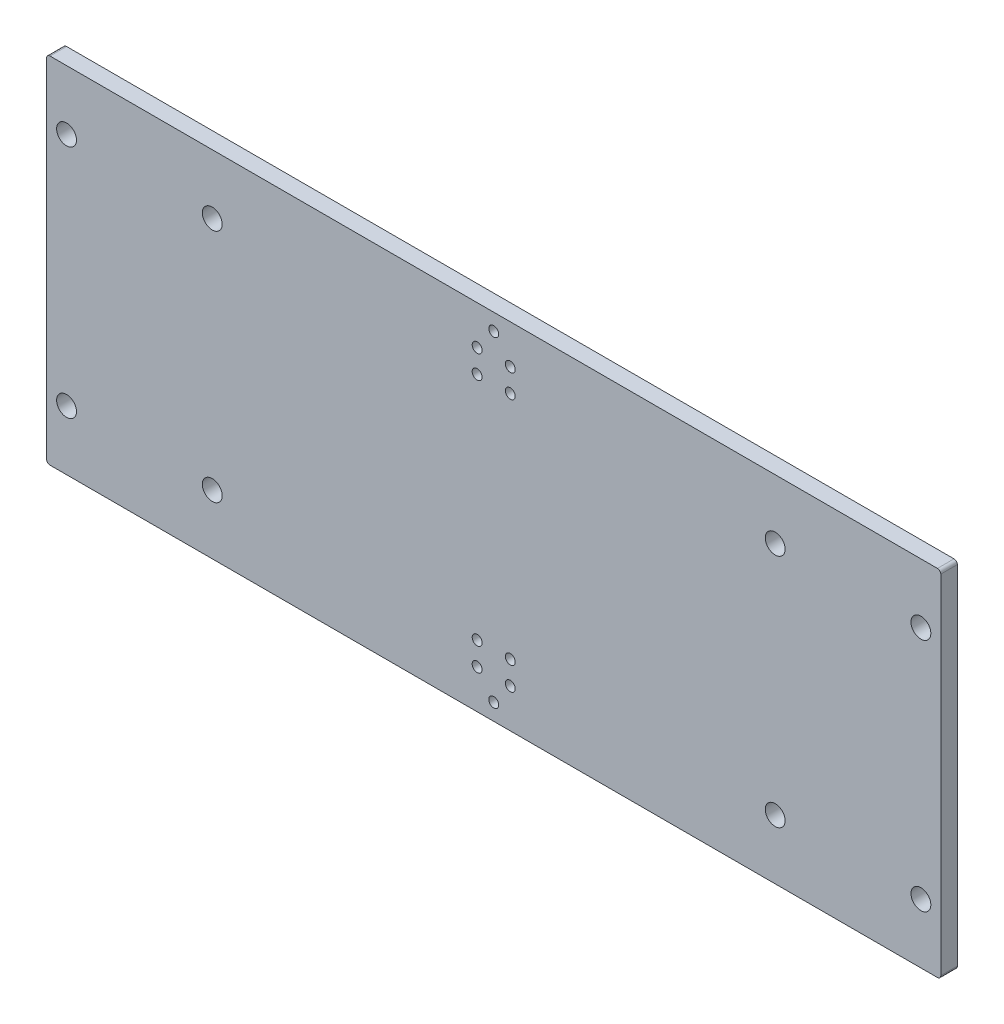
ISO-10303-21;
HEADER;
FILE_DESCRIPTION(('STEP AP214'),'2;1');
FILE_NAME('part.step','',(''),(''),'','','');
FILE_SCHEMA(('AUTOMOTIVE_DESIGN { 1 0 10303 214 1 1 1 1 }'));
ENDSEC;
DATA;
#1=APPLICATION_CONTEXT('core data for automotive mechanical design processes');
#2=APPLICATION_PROTOCOL_DEFINITION('international standard','automotive_design',2000,#1);
#3=PRODUCT_CONTEXT('',#1,'mechanical');
#4=PRODUCT('Part','Part','',(#3));
#5=PRODUCT_RELATED_PRODUCT_CATEGORY('part','',(#4));
#6=PRODUCT_DEFINITION_FORMATION('','',#4);
#7=PRODUCT_DEFINITION_CONTEXT('part definition',#1,'design');
#8=PRODUCT_DEFINITION('design','',#6,#7);
#9=PRODUCT_DEFINITION_SHAPE('','',#8);
#10=(LENGTH_UNIT() NAMED_UNIT(*) SI_UNIT(.MILLI.,.METRE.));
#11=(NAMED_UNIT(*) PLANE_ANGLE_UNIT() SI_UNIT($,.RADIAN.));
#12=(NAMED_UNIT(*) SI_UNIT($,.STERADIAN.) SOLID_ANGLE_UNIT());
#13=UNCERTAINTY_MEASURE_WITH_UNIT(LENGTH_MEASURE(1.E-05),#10,'distance_accuracy_value','');
#14=(GEOMETRIC_REPRESENTATION_CONTEXT(3) GLOBAL_UNCERTAINTY_ASSIGNED_CONTEXT((#13)) GLOBAL_UNIT_ASSIGNED_CONTEXT((#10,
#11,#12)) REPRESENTATION_CONTEXT('',''));
#15=CARTESIAN_POINT('',(0.,0.,0.));
#16=DIRECTION('',(0.,0.,1.));
#17=DIRECTION('',(1.,0.,0.));
#18=AXIS2_PLACEMENT_3D('',#15,#16,#17);
#19=CARTESIAN_POINT('',(135.,-53.5,-5.));
#20=DIRECTION('',(1.,0.,0.));
#21=DIRECTION('',(0.,0.,-1.));
#22=AXIS2_PLACEMENT_3D('',#19,#20,#21);
#23=PLANE('',#22);
#24=DIRECTION('',(0.,1.,0.));
#25=VECTOR('',#24,1.);
#26=CARTESIAN_POINT('',(135.,-53.5,0.));
#27=LINE('',#26,#25);
#28=CARTESIAN_POINT('',(135.,-52.5,0.));
#29=VERTEX_POINT('',#28);
#30=CARTESIAN_POINT('',(135.,52.5,0.));
#31=VERTEX_POINT('',#30);
#32=EDGE_CURVE('E258',#29,#31,#27,.T.);
#33=ORIENTED_EDGE('',*,*,#32,.F.);
#34=DIRECTION('',(0.,0.,1.));
#35=VECTOR('',#34,1.);
#36=CARTESIAN_POINT('',(135.,-52.5,-5.));
#37=LINE('',#36,#35);
#38=CARTESIAN_POINT('',(135.,-52.5,-5.));
#39=VERTEX_POINT('',#38);
#40=EDGE_CURVE('E11',#29,#39,#37,.F.);
#41=ORIENTED_EDGE('',*,*,#40,.T.);
#42=DIRECTION('',(0.,1.,0.));
#43=VECTOR('',#42,1.);
#44=CARTESIAN_POINT('',(135.,-53.5,-5.));
#45=LINE('',#44,#43);
#46=CARTESIAN_POINT('',(135.,52.5,-5.));
#47=VERTEX_POINT('',#46);
#48=EDGE_CURVE('E259',#39,#47,#45,.T.);
#49=ORIENTED_EDGE('',*,*,#48,.T.);
#50=DIRECTION('',(0.,0.,1.));
#51=VECTOR('',#50,1.);
#52=CARTESIAN_POINT('',(135.,52.5,-5.));
#53=LINE('',#52,#51);
#54=EDGE_CURVE('E49',#47,#31,#53,.T.);
#55=ORIENTED_EDGE('',*,*,#54,.T.);
#56=EDGE_LOOP('',(#33,#41,#49,#55));
#57=FACE_BOUND('',#56,.T.);
#58=ADVANCED_FACE('F40',(#57),#23,.T.);
#59=CARTESIAN_POINT('',(-135.,-53.5,-5.));
#60=DIRECTION('',(0.,-1.,0.));
#61=DIRECTION('',(0.,0.,-1.));
#62=AXIS2_PLACEMENT_3D('',#59,#60,#61);
#63=PLANE('',#62);
#64=DIRECTION('',(1.,0.,0.));
#65=VECTOR('',#64,1.);
#66=CARTESIAN_POINT('',(-135.,-53.5,0.));
#67=LINE('',#66,#65);
#68=CARTESIAN_POINT('',(-134.,-53.5,0.));
#69=VERTEX_POINT('',#68);
#70=CARTESIAN_POINT('',(134.,-53.5,0.));
#71=VERTEX_POINT('',#70);
#72=EDGE_CURVE('E127',#69,#71,#67,.T.);
#73=ORIENTED_EDGE('',*,*,#72,.F.);
#74=DIRECTION('',(0.,0.,1.));
#75=VECTOR('',#74,1.);
#76=CARTESIAN_POINT('',(-134.,-53.5,-5.));
#77=LINE('',#76,#75);
#78=CARTESIAN_POINT('',(-134.,-53.5,-5.));
#79=VERTEX_POINT('',#78);
#80=EDGE_CURVE('E145',#69,#79,#77,.F.);
#81=ORIENTED_EDGE('',*,*,#80,.T.);
#82=DIRECTION('',(1.,0.,0.));
#83=VECTOR('',#82,1.);
#84=CARTESIAN_POINT('',(-135.,-53.5,-5.));
#85=LINE('',#84,#83);
#86=CARTESIAN_POINT('',(134.,-53.5,-5.));
#87=VERTEX_POINT('',#86);
#88=EDGE_CURVE('E130',#79,#87,#85,.T.);
#89=ORIENTED_EDGE('',*,*,#88,.T.);
#90=DIRECTION('',(0.,0.,1.));
#91=VECTOR('',#90,1.);
#92=CARTESIAN_POINT('',(134.,-53.5,-5.));
#93=LINE('',#92,#91);
#94=EDGE_CURVE('E142',#87,#71,#93,.T.);
#95=ORIENTED_EDGE('',*,*,#94,.T.);
#96=EDGE_LOOP('',(#73,#81,#89,#95));
#97=FACE_BOUND('',#96,.T.);
#98=ADVANCED_FACE('F282',(#97),#63,.T.);
#99=CARTESIAN_POINT('',(-135.,-53.5,-5.));
#100=DIRECTION('',(-1.,0.,0.));
#101=DIRECTION('',(0.,0.,1.));
#102=AXIS2_PLACEMENT_3D('',#99,#100,#101);
#103=PLANE('',#102);
#104=DIRECTION('',(0.,-1.,0.));
#105=VECTOR('',#104,1.);
#106=CARTESIAN_POINT('',(-135.,-53.5,-5.));
#107=LINE('',#106,#105);
#108=CARTESIAN_POINT('',(-135.,52.5,-5.));
#109=VERTEX_POINT('',#108);
#110=CARTESIAN_POINT('',(-135.,-52.5,-5.));
#111=VERTEX_POINT('',#110);
#112=EDGE_CURVE('E135',#109,#111,#107,.T.);
#113=ORIENTED_EDGE('',*,*,#112,.T.);
#114=DIRECTION('',(0.,0.,1.));
#115=VECTOR('',#114,1.);
#116=CARTESIAN_POINT('',(-135.,-52.5,-5.));
#117=LINE('',#116,#115);
#118=CARTESIAN_POINT('',(-135.,-52.5,0.));
#119=VERTEX_POINT('',#118);
#120=EDGE_CURVE('E126',#111,#119,#117,.T.);
#121=ORIENTED_EDGE('',*,*,#120,.T.);
#122=DIRECTION('',(0.,-1.,0.));
#123=VECTOR('',#122,1.);
#124=CARTESIAN_POINT('',(-135.,-53.5,0.));
#125=LINE('',#124,#123);
#126=CARTESIAN_POINT('',(-135.,52.5,0.));
#127=VERTEX_POINT('',#126);
#128=EDGE_CURVE('E111',#127,#119,#125,.T.);
#129=ORIENTED_EDGE('',*,*,#128,.F.);
#130=DIRECTION('',(0.,0.,1.));
#131=VECTOR('',#130,1.);
#132=CARTESIAN_POINT('',(-135.,52.5,-5.));
#133=LINE('',#132,#131);
#134=EDGE_CURVE('E124',#127,#109,#133,.F.);
#135=ORIENTED_EDGE('',*,*,#134,.T.);
#136=EDGE_LOOP('',(#113,#121,#129,#135));
#137=FACE_BOUND('',#136,.T.);
#138=ADVANCED_FACE('F123',(#137),#103,.T.);
#139=CARTESIAN_POINT('',(-135.,53.5,-5.));
#140=DIRECTION('',(0.,1.,0.));
#141=DIRECTION('',(0.,0.,1.));
#142=AXIS2_PLACEMENT_3D('',#139,#140,#141);
#143=PLANE('',#142);
#144=DIRECTION('',(-1.,0.,0.));
#145=VECTOR('',#144,1.);
#146=CARTESIAN_POINT('',(-135.,53.5,-5.));
#147=LINE('',#146,#145);
#148=CARTESIAN_POINT('',(134.,53.5,-5.));
#149=VERTEX_POINT('',#148);
#150=CARTESIAN_POINT('',(-134.,53.5,-5.));
#151=VERTEX_POINT('',#150);
#152=EDGE_CURVE('E262',#149,#151,#147,.T.);
#153=ORIENTED_EDGE('',*,*,#152,.T.);
#154=DIRECTION('',(0.,0.,1.));
#155=VECTOR('',#154,1.);
#156=CARTESIAN_POINT('',(-134.,53.5,-5.));
#157=LINE('',#156,#155);
#158=CARTESIAN_POINT('',(-134.,53.5,0.));
#159=VERTEX_POINT('',#158);
#160=EDGE_CURVE('E155',#151,#159,#157,.T.);
#161=ORIENTED_EDGE('',*,*,#160,.T.);
#162=DIRECTION('',(-1.,0.,0.));
#163=VECTOR('',#162,1.);
#164=CARTESIAN_POINT('',(-135.,53.5,0.));
#165=LINE('',#164,#163);
#166=CARTESIAN_POINT('',(134.,53.5,0.));
#167=VERTEX_POINT('',#166);
#168=EDGE_CURVE('E112',#167,#159,#165,.T.);
#169=ORIENTED_EDGE('',*,*,#168,.F.);
#170=DIRECTION('',(0.,0.,1.));
#171=VECTOR('',#170,1.);
#172=CARTESIAN_POINT('',(134.,53.5,-5.));
#173=LINE('',#172,#171);
#174=EDGE_CURVE('E64',#167,#149,#173,.F.);
#175=ORIENTED_EDGE('',*,*,#174,.T.);
#176=EDGE_LOOP('',(#153,#161,#169,#175));
#177=FACE_BOUND('',#176,.T.);
#178=ADVANCED_FACE('F305',(#177),#143,.T.);
#179=CARTESIAN_POINT('',(0.,0.,-5.));
#180=DIRECTION('',(0.,0.,-1.));
#181=DIRECTION('',(-1.,0.,0.));
#182=AXIS2_PLACEMENT_3D('',#179,#180,#181);
#183=PLANE('',#182);
#184=CARTESIAN_POINT('',(5.,-34.75,-5.));
#185=DIRECTION('',(0.,0.,1.));
#186=DIRECTION('',(-1.,0.,0.));
#187=AXIS2_PLACEMENT_3D('',#184,#185,#186);
#188=CIRCLE('',#187,1.5);
#189=CARTESIAN_POINT('',(3.5,-34.75,-5.));
#190=VERTEX_POINT('',#189);
#191=EDGE_CURVE('E440',#190,#190,#188,.T.);
#192=ORIENTED_EDGE('',*,*,#191,.T.);
#193=EDGE_LOOP('',(#192));
#194=FACE_BOUND('',#193,.T.);
#195=CARTESIAN_POINT('',(-5.,-34.75,-5.));
#196=DIRECTION('',(0.,0.,1.));
#197=DIRECTION('',(-1.,0.,0.));
#198=AXIS2_PLACEMENT_3D('',#195,#196,#197);
#199=CIRCLE('',#198,1.5);
#200=CARTESIAN_POINT('',(-6.5,-34.75,-5.));
#201=VERTEX_POINT('',#200);
#202=EDGE_CURVE('E435',#201,#201,#199,.T.);
#203=ORIENTED_EDGE('',*,*,#202,.T.);
#204=EDGE_LOOP('',(#203));
#205=FACE_BOUND('',#204,.T.);
#206=CARTESIAN_POINT('',(-5.,-41.75,-5.));
#207=DIRECTION('',(0.,0.,1.));
#208=DIRECTION('',(-1.,0.,0.));
#209=AXIS2_PLACEMENT_3D('',#206,#207,#208);
#210=CIRCLE('',#209,1.5);
#211=CARTESIAN_POINT('',(-6.5,-41.75,-5.));
#212=VERTEX_POINT('',#211);
#213=EDGE_CURVE('E386',#212,#212,#210,.T.);
#214=ORIENTED_EDGE('',*,*,#213,.T.);
#215=EDGE_LOOP('',(#214));
#216=FACE_BOUND('',#215,.T.);
#217=CARTESIAN_POINT('',(5.,-41.75,-5.));
#218=DIRECTION('',(0.,0.,1.));
#219=DIRECTION('',(-1.,0.,0.));
#220=AXIS2_PLACEMENT_3D('',#217,#218,#219);
#221=CIRCLE('',#220,1.5);
#222=CARTESIAN_POINT('',(3.5,-41.75,-5.));
#223=VERTEX_POINT('',#222);
#224=EDGE_CURVE('E177',#223,#223,#221,.T.);
#225=ORIENTED_EDGE('',*,*,#224,.T.);
#226=EDGE_LOOP('',(#225));
#227=FACE_BOUND('',#226,.T.);
#228=CARTESIAN_POINT('',(5.,34.75,-5.));
#229=DIRECTION('',(0.,0.,-1.));
#230=DIRECTION('',(-1.,0.,0.));
#231=AXIS2_PLACEMENT_3D('',#228,#229,#230);
#232=CIRCLE('',#231,1.5);
#233=CARTESIAN_POINT('',(3.5,34.75,-5.));
#234=VERTEX_POINT('',#233);
#235=EDGE_CURVE('E184',#234,#234,#232,.T.);
#236=ORIENTED_EDGE('',*,*,#235,.F.);
#237=EDGE_LOOP('',(#236));
#238=FACE_BOUND('',#237,.T.);
#239=CARTESIAN_POINT('',(-5.,34.75,-5.));
#240=DIRECTION('',(0.,0.,-1.));
#241=DIRECTION('',(-1.,0.,0.));
#242=AXIS2_PLACEMENT_3D('',#239,#240,#241);
#243=CIRCLE('',#242,1.5);
#244=CARTESIAN_POINT('',(-6.5,34.75,-5.));
#245=VERTEX_POINT('',#244);
#246=EDGE_CURVE('E188',#245,#245,#243,.T.);
#247=ORIENTED_EDGE('',*,*,#246,.F.);
#248=EDGE_LOOP('',(#247));
#249=FACE_BOUND('',#248,.T.);
#250=CARTESIAN_POINT('',(-5.,41.75,-5.));
#251=DIRECTION('',(0.,0.,-1.));
#252=DIRECTION('',(-1.,0.,0.));
#253=AXIS2_PLACEMENT_3D('',#250,#251,#252);
#254=CIRCLE('',#253,1.5);
#255=CARTESIAN_POINT('',(-6.5,41.75,-5.));
#256=VERTEX_POINT('',#255);
#257=EDGE_CURVE('E193',#256,#256,#254,.T.);
#258=ORIENTED_EDGE('',*,*,#257,.F.);
#259=EDGE_LOOP('',(#258));
#260=FACE_BOUND('',#259,.T.);
#261=CARTESIAN_POINT('',(5.,41.75,-5.));
#262=DIRECTION('',(0.,0.,-1.));
#263=DIRECTION('',(-1.,0.,0.));
#264=AXIS2_PLACEMENT_3D('',#261,#262,#263);
#265=CIRCLE('',#264,1.5);
#266=CARTESIAN_POINT('',(3.5,41.75,-5.));
#267=VERTEX_POINT('',#266);
#268=EDGE_CURVE('E163',#267,#267,#265,.T.);
#269=ORIENTED_EDGE('',*,*,#268,.F.);
#270=EDGE_LOOP('',(#269));
#271=FACE_BOUND('',#270,.T.);
#272=CARTESIAN_POINT('',(0.,-48.5,-5.));
#273=DIRECTION('',(0.,0.,-1.));
#274=DIRECTION('',(-1.,0.,0.));
#275=AXIS2_PLACEMENT_3D('',#272,#273,#274);
#276=CIRCLE('',#275,1.5);
#277=CARTESIAN_POINT('',(-1.5,-48.5,-5.));
#278=VERTEX_POINT('',#277);
#279=EDGE_CURVE('E201',#278,#278,#276,.F.);
#280=ORIENTED_EDGE('',*,*,#279,.T.);
#281=EDGE_LOOP('',(#280));
#282=FACE_BOUND('',#281,.T.);
#283=CARTESIAN_POINT('',(0.,48.5,-5.));
#284=DIRECTION('',(0.,0.,-1.));
#285=DIRECTION('',(-1.,0.,0.));
#286=AXIS2_PLACEMENT_3D('',#283,#284,#285);
#287=CIRCLE('',#286,1.5);
#288=CARTESIAN_POINT('',(-1.5,48.5,-5.));
#289=VERTEX_POINT('',#288);
#290=EDGE_CURVE('E207',#289,#289,#287,.T.);
#291=ORIENTED_EDGE('',*,*,#290,.F.);
#292=EDGE_LOOP('',(#291));
#293=FACE_BOUND('',#292,.T.);
#294=CARTESIAN_POINT('',(129.,-35.5,-5.));
#295=DIRECTION('',(0.,0.,-1.));
#296=DIRECTION('',(-1.,0.,0.));
#297=AXIS2_PLACEMENT_3D('',#294,#295,#296);
#298=CIRCLE('',#297,2.99999999999999);
#299=CARTESIAN_POINT('',(126.,-35.5,-5.));
#300=VERTEX_POINT('',#299);
#301=EDGE_CURVE('E231',#300,#300,#298,.F.);
#302=ORIENTED_EDGE('',*,*,#301,.T.);
#303=EDGE_LOOP('',(#302));
#304=FACE_BOUND('',#303,.T.);
#305=CARTESIAN_POINT('',(85.,35.5,-5.));
#306=DIRECTION('',(0.,0.,-1.));
#307=DIRECTION('',(-1.,0.,0.));
#308=AXIS2_PLACEMENT_3D('',#305,#306,#307);
#309=CIRCLE('',#308,3.00000000000001);
#310=CARTESIAN_POINT('',(82.,35.5,-5.));
#311=VERTEX_POINT('',#310);
#312=EDGE_CURVE('E228',#311,#311,#309,.F.);
#313=ORIENTED_EDGE('',*,*,#312,.T.);
#314=EDGE_LOOP('',(#313));
#315=FACE_BOUND('',#314,.T.);
#316=CARTESIAN_POINT('',(85.,-35.5,-5.));
#317=DIRECTION('',(0.,0.,-1.));
#318=DIRECTION('',(-1.,0.,0.));
#319=AXIS2_PLACEMENT_3D('',#316,#317,#318);
#320=CIRCLE('',#319,3.00000000000001);
#321=CARTESIAN_POINT('',(82.,-35.5,-5.));
#322=VERTEX_POINT('',#321);
#323=EDGE_CURVE('E225',#322,#322,#320,.F.);
#324=ORIENTED_EDGE('',*,*,#323,.T.);
#325=EDGE_LOOP('',(#324));
#326=FACE_BOUND('',#325,.T.);
#327=CARTESIAN_POINT('',(129.,35.5,-5.));
#328=DIRECTION('',(0.,0.,-1.));
#329=DIRECTION('',(-1.,0.,0.));
#330=AXIS2_PLACEMENT_3D('',#327,#328,#329);
#331=CIRCLE('',#330,2.99999999999999);
#332=CARTESIAN_POINT('',(126.,35.5,-5.));
#333=VERTEX_POINT('',#332);
#334=EDGE_CURVE('E222',#333,#333,#331,.F.);
#335=ORIENTED_EDGE('',*,*,#334,.T.);
#336=EDGE_LOOP('',(#335));
#337=FACE_BOUND('',#336,.T.);
#338=CARTESIAN_POINT('',(-129.,-35.5,-5.));
#339=DIRECTION('',(0.,0.,-1.));
#340=DIRECTION('',(-1.,0.,0.));
#341=AXIS2_PLACEMENT_3D('',#338,#339,#340);
#342=CIRCLE('',#341,2.99999999999999);
#343=CARTESIAN_POINT('',(-132.,-35.5,-5.));
#344=VERTEX_POINT('',#343);
#345=EDGE_CURVE('E255',#344,#344,#342,.T.);
#346=ORIENTED_EDGE('',*,*,#345,.F.);
#347=EDGE_LOOP('',(#346));
#348=FACE_BOUND('',#347,.T.);
#349=CARTESIAN_POINT('',(-85.,35.5,-5.));
#350=DIRECTION('',(0.,0.,-1.));
#351=DIRECTION('',(-1.,0.,0.));
#352=AXIS2_PLACEMENT_3D('',#349,#350,#351);
#353=CIRCLE('',#352,3.00000000000001);
#354=CARTESIAN_POINT('',(-88.,35.5,-5.));
#355=VERTEX_POINT('',#354);
#356=EDGE_CURVE('E252',#355,#355,#353,.T.);
#357=ORIENTED_EDGE('',*,*,#356,.F.);
#358=EDGE_LOOP('',(#357));
#359=FACE_BOUND('',#358,.T.);
#360=CARTESIAN_POINT('',(-85.,-35.5,-5.));
#361=DIRECTION('',(0.,0.,-1.));
#362=DIRECTION('',(-1.,0.,0.));
#363=AXIS2_PLACEMENT_3D('',#360,#361,#362);
#364=CIRCLE('',#363,3.00000000000001);
#365=CARTESIAN_POINT('',(-88.,-35.5,-5.));
#366=VERTEX_POINT('',#365);
#367=EDGE_CURVE('E249',#366,#366,#364,.T.);
#368=ORIENTED_EDGE('',*,*,#367,.F.);
#369=EDGE_LOOP('',(#368));
#370=FACE_BOUND('',#369,.T.);
#371=CARTESIAN_POINT('',(-129.,35.5,-5.));
#372=DIRECTION('',(0.,0.,-1.));
#373=DIRECTION('',(-1.,0.,0.));
#374=AXIS2_PLACEMENT_3D('',#371,#372,#373);
#375=CIRCLE('',#374,2.99999999999999);
#376=CARTESIAN_POINT('',(-132.,35.5,-5.));
#377=VERTEX_POINT('',#376);
#378=EDGE_CURVE('E246',#377,#377,#375,.T.);
#379=ORIENTED_EDGE('',*,*,#378,.F.);
#380=EDGE_LOOP('',(#379));
#381=FACE_BOUND('',#380,.T.);
#382=ORIENTED_EDGE('',*,*,#88,.F.);
#383=CARTESIAN_POINT('',(-134.,-52.5,-5.));
#384=DIRECTION('',(0.,0.,-1.));
#385=DIRECTION('',(-1.,0.,0.));
#386=AXIS2_PLACEMENT_3D('',#383,#384,#385);
#387=CIRCLE('',#386,1.);
#388=EDGE_CURVE('E152',#79,#111,#387,.T.);
#389=ORIENTED_EDGE('',*,*,#388,.T.);
#390=ORIENTED_EDGE('',*,*,#112,.F.);
#391=CARTESIAN_POINT('',(-134.,52.5,-5.));
#392=DIRECTION('',(0.,0.,-1.));
#393=DIRECTION('',(-1.,0.,0.));
#394=AXIS2_PLACEMENT_3D('',#391,#392,#393);
#395=CIRCLE('',#394,1.);
#396=EDGE_CURVE('E57',#109,#151,#395,.T.);
#397=ORIENTED_EDGE('',*,*,#396,.T.);
#398=ORIENTED_EDGE('',*,*,#152,.F.);
#399=CARTESIAN_POINT('',(134.,52.5,-5.));
#400=DIRECTION('',(0.,0.,-1.));
#401=DIRECTION('',(-1.,0.,0.));
#402=AXIS2_PLACEMENT_3D('',#399,#400,#401);
#403=CIRCLE('',#402,1.);
#404=EDGE_CURVE('E147',#149,#47,#403,.T.);
#405=ORIENTED_EDGE('',*,*,#404,.T.);
#406=ORIENTED_EDGE('',*,*,#48,.F.);
#407=CARTESIAN_POINT('',(134.,-52.5,-5.));
#408=DIRECTION('',(0.,0.,-1.));
#409=DIRECTION('',(-1.,0.,0.));
#410=AXIS2_PLACEMENT_3D('',#407,#408,#409);
#411=CIRCLE('',#410,1.);
#412=EDGE_CURVE('E149',#39,#87,#411,.T.);
#413=ORIENTED_EDGE('',*,*,#412,.T.);
#414=EDGE_LOOP('',(#382,#389,#390,#397,#398,#405,#406,#413));
#415=FACE_BOUND('',#414,.T.);
#416=ADVANCED_FACE('F278',(#194,#205,#216,#227,#238,#249,#260,#271,#282,#293,#304,#315,#326,
#337,#348,#359,#370,#381,#415),#183,.T.);
#417=CARTESIAN_POINT('',(0.,0.,0.));
#418=DIRECTION('',(0.,0.,-1.));
#419=DIRECTION('',(-1.,0.,0.));
#420=AXIS2_PLACEMENT_3D('',#417,#418,#419);
#421=PLANE('',#420);
#422=CARTESIAN_POINT('',(5.,-34.75,0.));
#423=DIRECTION('',(0.,0.,-1.));
#424=DIRECTION('',(-1.,0.,0.));
#425=AXIS2_PLACEMENT_3D('',#422,#423,#424);
#426=CIRCLE('',#425,1.5);
#427=CARTESIAN_POINT('',(3.5,-34.75,0.));
#428=VERTEX_POINT('',#427);
#429=EDGE_CURVE('E44',#428,#428,#426,.F.);
#430=ORIENTED_EDGE('',*,*,#429,.F.);
#431=EDGE_LOOP('',(#430));
#432=FACE_BOUND('',#431,.T.);
#433=CARTESIAN_POINT('',(-5.,-34.75,0.));
#434=DIRECTION('',(0.,0.,-1.));
#435=DIRECTION('',(-1.,0.,0.));
#436=AXIS2_PLACEMENT_3D('',#433,#434,#435);
#437=CIRCLE('',#436,1.5);
#438=CARTESIAN_POINT('',(-6.5,-34.75,0.));
#439=VERTEX_POINT('',#438);
#440=EDGE_CURVE('E179',#439,#439,#437,.F.);
#441=ORIENTED_EDGE('',*,*,#440,.F.);
#442=EDGE_LOOP('',(#441));
#443=FACE_BOUND('',#442,.T.);
#444=CARTESIAN_POINT('',(-5.,-41.75,0.));
#445=DIRECTION('',(0.,0.,-1.));
#446=DIRECTION('',(-1.,0.,0.));
#447=AXIS2_PLACEMENT_3D('',#444,#445,#446);
#448=CIRCLE('',#447,1.5);
#449=CARTESIAN_POINT('',(-6.5,-41.75,0.));
#450=VERTEX_POINT('',#449);
#451=EDGE_CURVE('E176',#450,#450,#448,.F.);
#452=ORIENTED_EDGE('',*,*,#451,.F.);
#453=EDGE_LOOP('',(#452));
#454=FACE_BOUND('',#453,.T.);
#455=CARTESIAN_POINT('',(5.,-41.75,0.));
#456=DIRECTION('',(0.,0.,-1.));
#457=DIRECTION('',(-1.,0.,0.));
#458=AXIS2_PLACEMENT_3D('',#455,#456,#457);
#459=CIRCLE('',#458,1.5);
#460=CARTESIAN_POINT('',(3.5,-41.75,0.));
#461=VERTEX_POINT('',#460);
#462=EDGE_CURVE('E173',#461,#461,#459,.F.);
#463=ORIENTED_EDGE('',*,*,#462,.F.);
#464=EDGE_LOOP('',(#463));
#465=FACE_BOUND('',#464,.T.);
#466=CARTESIAN_POINT('',(5.,34.75,0.));
#467=DIRECTION('',(0.,0.,-1.));
#468=DIRECTION('',(-1.,0.,0.));
#469=AXIS2_PLACEMENT_3D('',#466,#467,#468);
#470=CIRCLE('',#469,1.5);
#471=CARTESIAN_POINT('',(3.5,34.75,0.));
#472=VERTEX_POINT('',#471);
#473=EDGE_CURVE('E169',#472,#472,#470,.T.);
#474=ORIENTED_EDGE('',*,*,#473,.T.);
#475=EDGE_LOOP('',(#474));
#476=FACE_BOUND('',#475,.T.);
#477=CARTESIAN_POINT('',(-5.,34.75,0.));
#478=DIRECTION('',(0.,0.,-1.));
#479=DIRECTION('',(-1.,0.,0.));
#480=AXIS2_PLACEMENT_3D('',#477,#478,#479);
#481=CIRCLE('',#480,1.5);
#482=CARTESIAN_POINT('',(-6.5,34.75,0.));
#483=VERTEX_POINT('',#482);
#484=EDGE_CURVE('E166',#483,#483,#481,.T.);
#485=ORIENTED_EDGE('',*,*,#484,.T.);
#486=EDGE_LOOP('',(#485));
#487=FACE_BOUND('',#486,.T.);
#488=CARTESIAN_POINT('',(-5.,41.75,0.));
#489=DIRECTION('',(0.,0.,-1.));
#490=DIRECTION('',(-1.,0.,0.));
#491=AXIS2_PLACEMENT_3D('',#488,#489,#490);
#492=CIRCLE('',#491,1.5);
#493=CARTESIAN_POINT('',(-6.5,41.75,0.));
#494=VERTEX_POINT('',#493);
#495=EDGE_CURVE('E162',#494,#494,#492,.T.);
#496=ORIENTED_EDGE('',*,*,#495,.T.);
#497=EDGE_LOOP('',(#496));
#498=FACE_BOUND('',#497,.T.);
#499=CARTESIAN_POINT('',(5.,41.75,0.));
#500=DIRECTION('',(0.,0.,-1.));
#501=DIRECTION('',(-1.,0.,0.));
#502=AXIS2_PLACEMENT_3D('',#499,#500,#501);
#503=CIRCLE('',#502,1.5);
#504=CARTESIAN_POINT('',(3.5,41.75,0.));
#505=VERTEX_POINT('',#504);
#506=EDGE_CURVE('E159',#505,#505,#503,.T.);
#507=ORIENTED_EDGE('',*,*,#506,.T.);
#508=EDGE_LOOP('',(#507));
#509=FACE_BOUND('',#508,.T.);
#510=CARTESIAN_POINT('',(0.,-48.5,0.));
#511=DIRECTION('',(0.,0.,-1.));
#512=DIRECTION('',(1.,0.,0.));
#513=AXIS2_PLACEMENT_3D('',#510,#511,#512);
#514=CIRCLE('',#513,1.5);
#515=CARTESIAN_POINT('',(1.5,-48.5,0.));
#516=VERTEX_POINT('',#515);
#517=EDGE_CURVE('E172',#516,#516,#514,.T.);
#518=ORIENTED_EDGE('',*,*,#517,.T.);
#519=EDGE_LOOP('',(#518));
#520=FACE_BOUND('',#519,.T.);
#521=CARTESIAN_POINT('',(0.,48.5,0.));
#522=DIRECTION('',(0.,0.,1.));
#523=DIRECTION('',(1.,0.,0.));
#524=AXIS2_PLACEMENT_3D('',#521,#522,#523);
#525=CIRCLE('',#524,1.5);
#526=CARTESIAN_POINT('',(1.5,48.5,0.));
#527=VERTEX_POINT('',#526);
#528=EDGE_CURVE('E204',#527,#527,#525,.T.);
#529=ORIENTED_EDGE('',*,*,#528,.F.);
#530=EDGE_LOOP('',(#529));
#531=FACE_BOUND('',#530,.T.);
#532=CARTESIAN_POINT('',(129.,-35.5,0.));
#533=DIRECTION('',(0.,0.,-1.));
#534=DIRECTION('',(-1.,0.,0.));
#535=AXIS2_PLACEMENT_3D('',#532,#533,#534);
#536=CIRCLE('',#535,2.99999999999999);
#537=CARTESIAN_POINT('',(126.,-35.5,0.));
#538=VERTEX_POINT('',#537);
#539=EDGE_CURVE('E214',#538,#538,#536,.T.);
#540=ORIENTED_EDGE('',*,*,#539,.T.);
#541=EDGE_LOOP('',(#540));
#542=FACE_BOUND('',#541,.T.);
#543=CARTESIAN_POINT('',(85.,35.5,0.));
#544=DIRECTION('',(0.,0.,-1.));
#545=DIRECTION('',(-1.,0.,0.));
#546=AXIS2_PLACEMENT_3D('',#543,#544,#545);
#547=CIRCLE('',#546,3.00000000000001);
#548=CARTESIAN_POINT('',(82.,35.5,0.));
#549=VERTEX_POINT('',#548);
#550=EDGE_CURVE('E213',#549,#549,#547,.T.);
#551=ORIENTED_EDGE('',*,*,#550,.T.);
#552=EDGE_LOOP('',(#551));
#553=FACE_BOUND('',#552,.T.);
#554=CARTESIAN_POINT('',(85.,-35.5,0.));
#555=DIRECTION('',(0.,0.,-1.));
#556=DIRECTION('',(-1.,0.,0.));
#557=AXIS2_PLACEMENT_3D('',#554,#555,#556);
#558=CIRCLE('',#557,3.00000000000001);
#559=CARTESIAN_POINT('',(82.,-35.5,0.));
#560=VERTEX_POINT('',#559);
#561=EDGE_CURVE('E210',#560,#560,#558,.T.);
#562=ORIENTED_EDGE('',*,*,#561,.T.);
#563=EDGE_LOOP('',(#562));
#564=FACE_BOUND('',#563,.T.);
#565=CARTESIAN_POINT('',(129.,35.5,0.));
#566=DIRECTION('',(0.,0.,-1.));
#567=DIRECTION('',(-1.,0.,0.));
#568=AXIS2_PLACEMENT_3D('',#565,#566,#567);
#569=CIRCLE('',#568,2.99999999999999);
#570=CARTESIAN_POINT('',(126.,35.5,0.));
#571=VERTEX_POINT('',#570);
#572=EDGE_CURVE('E217',#571,#571,#569,.T.);
#573=ORIENTED_EDGE('',*,*,#572,.T.);
#574=EDGE_LOOP('',(#573));
#575=FACE_BOUND('',#574,.T.);
#576=CARTESIAN_POINT('',(-129.,-35.5,0.));
#577=DIRECTION('',(0.,0.,1.));
#578=DIRECTION('',(1.,0.,0.));
#579=AXIS2_PLACEMENT_3D('',#576,#577,#578);
#580=CIRCLE('',#579,2.99999999999999);
#581=CARTESIAN_POINT('',(-126.,-35.5,0.));
#582=VERTEX_POINT('',#581);
#583=EDGE_CURVE('E238',#582,#582,#580,.T.);
#584=ORIENTED_EDGE('',*,*,#583,.F.);
#585=EDGE_LOOP('',(#584));
#586=FACE_BOUND('',#585,.T.);
#587=CARTESIAN_POINT('',(-85.,35.5,0.));
#588=DIRECTION('',(0.,0.,1.));
#589=DIRECTION('',(1.,0.,0.));
#590=AXIS2_PLACEMENT_3D('',#587,#588,#589);
#591=CIRCLE('',#590,3.00000000000001);
#592=CARTESIAN_POINT('',(-82.,35.5,0.));
#593=VERTEX_POINT('',#592);
#594=EDGE_CURVE('E237',#593,#593,#591,.T.);
#595=ORIENTED_EDGE('',*,*,#594,.F.);
#596=EDGE_LOOP('',(#595));
#597=FACE_BOUND('',#596,.T.);
#598=CARTESIAN_POINT('',(-85.,-35.5,0.));
#599=DIRECTION('',(0.,0.,1.));
#600=DIRECTION('',(1.,0.,0.));
#601=AXIS2_PLACEMENT_3D('',#598,#599,#600);
#602=CIRCLE('',#601,3.00000000000001);
#603=CARTESIAN_POINT('',(-82.,-35.5,0.));
#604=VERTEX_POINT('',#603);
#605=EDGE_CURVE('E234',#604,#604,#602,.T.);
#606=ORIENTED_EDGE('',*,*,#605,.F.);
#607=EDGE_LOOP('',(#606));
#608=FACE_BOUND('',#607,.T.);
#609=CARTESIAN_POINT('',(-129.,35.5,0.));
#610=DIRECTION('',(0.,0.,1.));
#611=DIRECTION('',(1.,0.,0.));
#612=AXIS2_PLACEMENT_3D('',#609,#610,#611);
#613=CIRCLE('',#612,2.99999999999999);
#614=CARTESIAN_POINT('',(-126.,35.5,0.));
#615=VERTEX_POINT('',#614);
#616=EDGE_CURVE('E241',#615,#615,#613,.T.);
#617=ORIENTED_EDGE('',*,*,#616,.F.);
#618=EDGE_LOOP('',(#617));
#619=FACE_BOUND('',#618,.T.);
#620=ORIENTED_EDGE('',*,*,#128,.T.);
#621=CARTESIAN_POINT('',(-134.,-52.5,0.));
#622=DIRECTION('',(0.,0.,-1.));
#623=DIRECTION('',(-1.,0.,0.));
#624=AXIS2_PLACEMENT_3D('',#621,#622,#623);
#625=CIRCLE('',#624,1.);
#626=EDGE_CURVE('E117',#119,#69,#625,.F.);
#627=ORIENTED_EDGE('',*,*,#626,.T.);
#628=ORIENTED_EDGE('',*,*,#72,.T.);
#629=CARTESIAN_POINT('',(134.,-52.5,0.));
#630=DIRECTION('',(0.,0.,-1.));
#631=DIRECTION('',(-1.,0.,0.));
#632=AXIS2_PLACEMENT_3D('',#629,#630,#631);
#633=CIRCLE('',#632,1.);
#634=EDGE_CURVE('E118',#71,#29,#633,.F.);
#635=ORIENTED_EDGE('',*,*,#634,.T.);
#636=ORIENTED_EDGE('',*,*,#32,.T.);
#637=CARTESIAN_POINT('',(134.,52.5,0.));
#638=DIRECTION('',(0.,0.,-1.));
#639=DIRECTION('',(-1.,0.,0.));
#640=AXIS2_PLACEMENT_3D('',#637,#638,#639);
#641=CIRCLE('',#640,1.);
#642=EDGE_CURVE('E132',#31,#167,#641,.F.);
#643=ORIENTED_EDGE('',*,*,#642,.T.);
#644=ORIENTED_EDGE('',*,*,#168,.T.);
#645=CARTESIAN_POINT('',(-134.,52.5,0.));
#646=DIRECTION('',(0.,0.,-1.));
#647=DIRECTION('',(-1.,0.,0.));
#648=AXIS2_PLACEMENT_3D('',#645,#646,#647);
#649=CIRCLE('',#648,1.);
#650=EDGE_CURVE('E108',#159,#127,#649,.F.);
#651=ORIENTED_EDGE('',*,*,#650,.T.);
#652=EDGE_LOOP('',(#620,#627,#628,#635,#636,#643,#644,#651));
#653=FACE_BOUND('',#652,.T.);
#654=ADVANCED_FACE('F110',(#432,#443,#454,#465,#476,#487,#498,#509,#520,#531,#542,#553,#564,
#575,#586,#597,#608,#619,#653),#421,.F.);
#655=CARTESIAN_POINT('',(-129.,35.5,-10.));
#656=DIRECTION('',(0.,0.,1.));
#657=DIRECTION('',(1.,0.,0.));
#658=AXIS2_PLACEMENT_3D('',#655,#656,#657);
#659=CYLINDRICAL_SURFACE('',#658,2.99999999999999);
#660=ORIENTED_EDGE('',*,*,#378,.T.);
#661=EDGE_LOOP('',(#660));
#662=FACE_BOUND('',#661,.T.);
#663=ORIENTED_EDGE('',*,*,#616,.T.);
#664=EDGE_LOOP('',(#663));
#665=FACE_BOUND('',#664,.T.);
#666=ADVANCED_FACE('F312',(#662,#665),#659,.F.);
#667=CARTESIAN_POINT('',(-85.,-35.5,-10.));
#668=DIRECTION('',(0.,0.,1.));
#669=DIRECTION('',(1.,0.,0.));
#670=AXIS2_PLACEMENT_3D('',#667,#668,#669);
#671=CYLINDRICAL_SURFACE('',#670,3.00000000000001);
#672=ORIENTED_EDGE('',*,*,#367,.T.);
#673=EDGE_LOOP('',(#672));
#674=FACE_BOUND('',#673,.T.);
#675=ORIENTED_EDGE('',*,*,#605,.T.);
#676=EDGE_LOOP('',(#675));
#677=FACE_BOUND('',#676,.T.);
#678=ADVANCED_FACE('F319',(#674,#677),#671,.F.);
#679=CARTESIAN_POINT('',(-85.,35.5,-10.));
#680=DIRECTION('',(0.,0.,1.));
#681=DIRECTION('',(1.,0.,0.));
#682=AXIS2_PLACEMENT_3D('',#679,#680,#681);
#683=CYLINDRICAL_SURFACE('',#682,3.00000000000001);
#684=ORIENTED_EDGE('',*,*,#356,.T.);
#685=EDGE_LOOP('',(#684));
#686=FACE_BOUND('',#685,.T.);
#687=ORIENTED_EDGE('',*,*,#594,.T.);
#688=EDGE_LOOP('',(#687));
#689=FACE_BOUND('',#688,.T.);
#690=ADVANCED_FACE('F321',(#686,#689),#683,.F.);
#691=CARTESIAN_POINT('',(-129.,-35.5,-10.));
#692=DIRECTION('',(0.,0.,1.));
#693=DIRECTION('',(1.,0.,0.));
#694=AXIS2_PLACEMENT_3D('',#691,#692,#693);
#695=CYLINDRICAL_SURFACE('',#694,2.99999999999999);
#696=ORIENTED_EDGE('',*,*,#345,.T.);
#697=EDGE_LOOP('',(#696));
#698=FACE_BOUND('',#697,.T.);
#699=ORIENTED_EDGE('',*,*,#583,.T.);
#700=EDGE_LOOP('',(#699));
#701=FACE_BOUND('',#700,.T.);
#702=ADVANCED_FACE('F324',(#698,#701),#695,.F.);
#703=CARTESIAN_POINT('',(129.,35.5,-10.));
#704=DIRECTION('',(0.,0.,1.));
#705=DIRECTION('',(1.,0.,0.));
#706=AXIS2_PLACEMENT_3D('',#703,#704,#705);
#707=CYLINDRICAL_SURFACE('',#706,2.99999999999999);
#708=ORIENTED_EDGE('',*,*,#334,.F.);
#709=EDGE_LOOP('',(#708));
#710=FACE_BOUND('',#709,.T.);
#711=ORIENTED_EDGE('',*,*,#572,.F.);
#712=EDGE_LOOP('',(#711));
#713=FACE_BOUND('',#712,.T.);
#714=ADVANCED_FACE('F328',(#710,#713),#707,.F.);
#715=CARTESIAN_POINT('',(85.,-35.5,-10.));
#716=DIRECTION('',(0.,0.,1.));
#717=DIRECTION('',(1.,0.,0.));
#718=AXIS2_PLACEMENT_3D('',#715,#716,#717);
#719=CYLINDRICAL_SURFACE('',#718,3.00000000000001);
#720=ORIENTED_EDGE('',*,*,#323,.F.);
#721=EDGE_LOOP('',(#720));
#722=FACE_BOUND('',#721,.T.);
#723=ORIENTED_EDGE('',*,*,#561,.F.);
#724=EDGE_LOOP('',(#723));
#725=FACE_BOUND('',#724,.T.);
#726=ADVANCED_FACE('F335',(#722,#725),#719,.F.);
#727=CARTESIAN_POINT('',(85.,35.5,-10.));
#728=DIRECTION('',(0.,0.,1.));
#729=DIRECTION('',(1.,0.,0.));
#730=AXIS2_PLACEMENT_3D('',#727,#728,#729);
#731=CYLINDRICAL_SURFACE('',#730,3.00000000000001);
#732=ORIENTED_EDGE('',*,*,#312,.F.);
#733=EDGE_LOOP('',(#732));
#734=FACE_BOUND('',#733,.T.);
#735=ORIENTED_EDGE('',*,*,#550,.F.);
#736=EDGE_LOOP('',(#735));
#737=FACE_BOUND('',#736,.T.);
#738=ADVANCED_FACE('F337',(#734,#737),#731,.F.);
#739=CARTESIAN_POINT('',(129.,-35.5,-10.));
#740=DIRECTION('',(0.,0.,1.));
#741=DIRECTION('',(1.,0.,0.));
#742=AXIS2_PLACEMENT_3D('',#739,#740,#741);
#743=CYLINDRICAL_SURFACE('',#742,2.99999999999999);
#744=ORIENTED_EDGE('',*,*,#301,.F.);
#745=EDGE_LOOP('',(#744));
#746=FACE_BOUND('',#745,.T.);
#747=ORIENTED_EDGE('',*,*,#539,.F.);
#748=EDGE_LOOP('',(#747));
#749=FACE_BOUND('',#748,.T.);
#750=ADVANCED_FACE('F340',(#746,#749),#743,.F.);
#751=CARTESIAN_POINT('',(0.,48.5,-10.));
#752=DIRECTION('',(0.,0.,1.));
#753=DIRECTION('',(1.,0.,0.));
#754=AXIS2_PLACEMENT_3D('',#751,#752,#753);
#755=CYLINDRICAL_SURFACE('',#754,1.5);
#756=ORIENTED_EDGE('',*,*,#290,.T.);
#757=EDGE_LOOP('',(#756));
#758=FACE_BOUND('',#757,.T.);
#759=ORIENTED_EDGE('',*,*,#528,.T.);
#760=EDGE_LOOP('',(#759));
#761=FACE_BOUND('',#760,.T.);
#762=ADVANCED_FACE('F294',(#758,#761),#755,.F.);
#763=CARTESIAN_POINT('',(0.,-48.5,-10.));
#764=DIRECTION('',(0.,0.,1.));
#765=DIRECTION('',(1.,0.,0.));
#766=AXIS2_PLACEMENT_3D('',#763,#764,#765);
#767=CYLINDRICAL_SURFACE('',#766,1.5);
#768=ORIENTED_EDGE('',*,*,#279,.F.);
#769=EDGE_LOOP('',(#768));
#770=FACE_BOUND('',#769,.T.);
#771=ORIENTED_EDGE('',*,*,#517,.F.);
#772=EDGE_LOOP('',(#771));
#773=FACE_BOUND('',#772,.T.);
#774=ADVANCED_FACE('F287',(#770,#773),#767,.F.);
#775=CARTESIAN_POINT('',(-134.,-52.5,-5.));
#776=DIRECTION('',(0.,0.,1.));
#777=DIRECTION('',(1.,0.,0.));
#778=AXIS2_PLACEMENT_3D('',#775,#776,#777);
#779=CYLINDRICAL_SURFACE('',#778,1.);
#780=ORIENTED_EDGE('',*,*,#388,.F.);
#781=ORIENTED_EDGE('',*,*,#80,.F.);
#782=ORIENTED_EDGE('',*,*,#626,.F.);
#783=ORIENTED_EDGE('',*,*,#120,.F.);
#784=EDGE_LOOP('',(#780,#781,#782,#783));
#785=FACE_BOUND('',#784,.T.);
#786=ADVANCED_FACE('F285',(#785),#779,.T.);
#787=CARTESIAN_POINT('',(-134.,52.5,-5.));
#788=DIRECTION('',(0.,0.,1.));
#789=DIRECTION('',(1.,0.,0.));
#790=AXIS2_PLACEMENT_3D('',#787,#788,#789);
#791=CYLINDRICAL_SURFACE('',#790,1.);
#792=ORIENTED_EDGE('',*,*,#396,.F.);
#793=ORIENTED_EDGE('',*,*,#134,.F.);
#794=ORIENTED_EDGE('',*,*,#650,.F.);
#795=ORIENTED_EDGE('',*,*,#160,.F.);
#796=EDGE_LOOP('',(#792,#793,#794,#795));
#797=FACE_BOUND('',#796,.T.);
#798=ADVANCED_FACE('F129',(#797),#791,.T.);
#799=CARTESIAN_POINT('',(134.,-52.5,-5.));
#800=DIRECTION('',(0.,0.,1.));
#801=DIRECTION('',(1.,0.,0.));
#802=AXIS2_PLACEMENT_3D('',#799,#800,#801);
#803=CYLINDRICAL_SURFACE('',#802,1.);
#804=ORIENTED_EDGE('',*,*,#412,.F.);
#805=ORIENTED_EDGE('',*,*,#40,.F.);
#806=ORIENTED_EDGE('',*,*,#634,.F.);
#807=ORIENTED_EDGE('',*,*,#94,.F.);
#808=EDGE_LOOP('',(#804,#805,#806,#807));
#809=FACE_BOUND('',#808,.T.);
#810=ADVANCED_FACE('F275',(#809),#803,.T.);
#811=CARTESIAN_POINT('',(134.,52.5,-5.));
#812=DIRECTION('',(0.,0.,1.));
#813=DIRECTION('',(1.,0.,0.));
#814=AXIS2_PLACEMENT_3D('',#811,#812,#813);
#815=CYLINDRICAL_SURFACE('',#814,1.);
#816=ORIENTED_EDGE('',*,*,#404,.F.);
#817=ORIENTED_EDGE('',*,*,#174,.F.);
#818=ORIENTED_EDGE('',*,*,#642,.F.);
#819=ORIENTED_EDGE('',*,*,#54,.F.);
#820=EDGE_LOOP('',(#816,#817,#818,#819));
#821=FACE_BOUND('',#820,.T.);
#822=ADVANCED_FACE('F42',(#821),#815,.T.);
#823=CARTESIAN_POINT('',(5.,41.75,5.));
#824=DIRECTION('',(0.,0.,-1.));
#825=DIRECTION('',(-1.,0.,0.));
#826=AXIS2_PLACEMENT_3D('',#823,#824,#825);
#827=CYLINDRICAL_SURFACE('',#826,1.5);
#828=ORIENTED_EDGE('',*,*,#268,.T.);
#829=EDGE_LOOP('',(#828));
#830=FACE_BOUND('',#829,.T.);
#831=ORIENTED_EDGE('',*,*,#506,.F.);
#832=EDGE_LOOP('',(#831));
#833=FACE_BOUND('',#832,.T.);
#834=ADVANCED_FACE('F351',(#830,#833),#827,.F.);
#835=CARTESIAN_POINT('',(-5.,41.75,5.));
#836=DIRECTION('',(0.,0.,-1.));
#837=DIRECTION('',(-1.,0.,0.));
#838=AXIS2_PLACEMENT_3D('',#835,#836,#837);
#839=CYLINDRICAL_SURFACE('',#838,1.5);
#840=ORIENTED_EDGE('',*,*,#257,.T.);
#841=EDGE_LOOP('',(#840));
#842=FACE_BOUND('',#841,.T.);
#843=ORIENTED_EDGE('',*,*,#495,.F.);
#844=EDGE_LOOP('',(#843));
#845=FACE_BOUND('',#844,.T.);
#846=ADVANCED_FACE('F354',(#842,#845),#839,.F.);
#847=CARTESIAN_POINT('',(-5.,34.75,5.));
#848=DIRECTION('',(0.,0.,-1.));
#849=DIRECTION('',(-1.,0.,0.));
#850=AXIS2_PLACEMENT_3D('',#847,#848,#849);
#851=CYLINDRICAL_SURFACE('',#850,1.5);
#852=ORIENTED_EDGE('',*,*,#246,.T.);
#853=EDGE_LOOP('',(#852));
#854=FACE_BOUND('',#853,.T.);
#855=ORIENTED_EDGE('',*,*,#484,.F.);
#856=EDGE_LOOP('',(#855));
#857=FACE_BOUND('',#856,.T.);
#858=ADVANCED_FACE('F360',(#854,#857),#851,.F.);
#859=CARTESIAN_POINT('',(5.,34.75,5.));
#860=DIRECTION('',(0.,0.,-1.));
#861=DIRECTION('',(-1.,0.,0.));
#862=AXIS2_PLACEMENT_3D('',#859,#860,#861);
#863=CYLINDRICAL_SURFACE('',#862,1.5);
#864=ORIENTED_EDGE('',*,*,#235,.T.);
#865=EDGE_LOOP('',(#864));
#866=FACE_BOUND('',#865,.T.);
#867=ORIENTED_EDGE('',*,*,#473,.F.);
#868=EDGE_LOOP('',(#867));
#869=FACE_BOUND('',#868,.T.);
#870=ADVANCED_FACE('F356',(#866,#869),#863,.F.);
#871=CARTESIAN_POINT('',(5.,-41.75,5.));
#872=DIRECTION('',(0.,0.,-1.));
#873=DIRECTION('',(-1.,0.,0.));
#874=AXIS2_PLACEMENT_3D('',#871,#872,#873);
#875=CYLINDRICAL_SURFACE('',#874,1.5);
#876=ORIENTED_EDGE('',*,*,#224,.F.);
#877=EDGE_LOOP('',(#876));
#878=FACE_BOUND('',#877,.T.);
#879=ORIENTED_EDGE('',*,*,#462,.T.);
#880=EDGE_LOOP('',(#879));
#881=FACE_BOUND('',#880,.T.);
#882=ADVANCED_FACE('F359',(#878,#881),#875,.F.);
#883=CARTESIAN_POINT('',(-5.,-41.75,5.));
#884=DIRECTION('',(0.,0.,-1.));
#885=DIRECTION('',(-1.,0.,0.));
#886=AXIS2_PLACEMENT_3D('',#883,#884,#885);
#887=CYLINDRICAL_SURFACE('',#886,1.5);
#888=ORIENTED_EDGE('',*,*,#213,.F.);
#889=EDGE_LOOP('',(#888));
#890=FACE_BOUND('',#889,.T.);
#891=ORIENTED_EDGE('',*,*,#451,.T.);
#892=EDGE_LOOP('',(#891));
#893=FACE_BOUND('',#892,.T.);
#894=ADVANCED_FACE('F369',(#890,#893),#887,.F.);
#895=CARTESIAN_POINT('',(-5.,-34.75,5.));
#896=DIRECTION('',(0.,0.,-1.));
#897=DIRECTION('',(-1.,0.,0.));
#898=AXIS2_PLACEMENT_3D('',#895,#896,#897);
#899=CYLINDRICAL_SURFACE('',#898,1.5);
#900=ORIENTED_EDGE('',*,*,#202,.F.);
#901=EDGE_LOOP('',(#900));
#902=FACE_BOUND('',#901,.T.);
#903=ORIENTED_EDGE('',*,*,#440,.T.);
#904=EDGE_LOOP('',(#903));
#905=FACE_BOUND('',#904,.T.);
#906=ADVANCED_FACE('F374',(#902,#905),#899,.F.);
#907=CARTESIAN_POINT('',(5.,-34.75,5.));
#908=DIRECTION('',(0.,0.,-1.));
#909=DIRECTION('',(-1.,0.,0.));
#910=AXIS2_PLACEMENT_3D('',#907,#908,#909);
#911=CYLINDRICAL_SURFACE('',#910,1.5);
#912=ORIENTED_EDGE('',*,*,#191,.F.);
#913=EDGE_LOOP('',(#912));
#914=FACE_BOUND('',#913,.T.);
#915=ORIENTED_EDGE('',*,*,#429,.T.);
#916=EDGE_LOOP('',(#915));
#917=FACE_BOUND('',#916,.T.);
#918=ADVANCED_FACE('F371',(#914,#917),#911,.F.);
#919=CLOSED_SHELL('',(#58,#98,#138,#178,#416,#654,#666,#678,#690,#702,#714,#726,#738,#750,#762,
#774,#786,#798,#810,#822,#834,#846,#858,#870,#882,#894,#906,#918));
#920=MANIFOLD_SOLID_BREP('B2',#919);
#921=ADVANCED_BREP_SHAPE_REPRESENTATION('',(#18,#920),#14);
#922=SHAPE_DEFINITION_REPRESENTATION(#9,#921);
ENDSEC;
END-ISO-10303-21;
